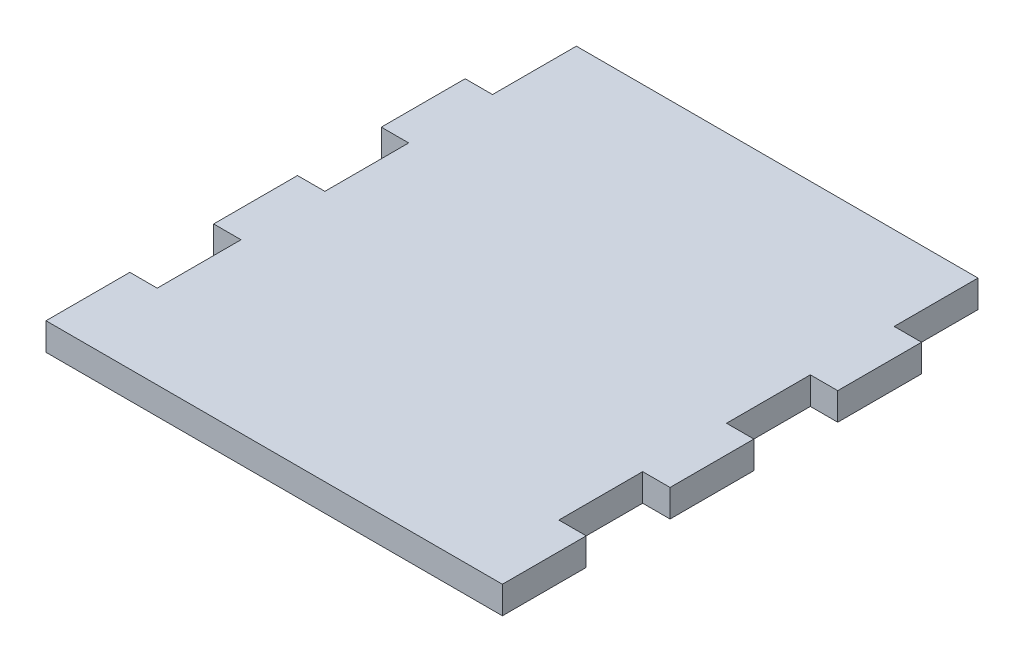
ISO-10303-21;
HEADER;
FILE_DESCRIPTION(('STEP AP214'),'2;1');
FILE_NAME('part.step','',(''),(''),'','','');
FILE_SCHEMA(('AUTOMOTIVE_DESIGN { 1 0 10303 214 1 1 1 1 }'));
ENDSEC;
DATA;
#1=APPLICATION_CONTEXT('core data for automotive mechanical design processes');
#2=APPLICATION_PROTOCOL_DEFINITION('international standard','automotive_design',2000,#1);
#3=PRODUCT_CONTEXT('',#1,'mechanical');
#4=PRODUCT('Part','Part','',(#3));
#5=PRODUCT_RELATED_PRODUCT_CATEGORY('part','',(#4));
#6=PRODUCT_DEFINITION_FORMATION('','',#4);
#7=PRODUCT_DEFINITION_CONTEXT('part definition',#1,'design');
#8=PRODUCT_DEFINITION('design','',#6,#7);
#9=PRODUCT_DEFINITION_SHAPE('','',#8);
#10=(LENGTH_UNIT() NAMED_UNIT(*) SI_UNIT(.MILLI.,.METRE.));
#11=(NAMED_UNIT(*) PLANE_ANGLE_UNIT() SI_UNIT($,.RADIAN.));
#12=(NAMED_UNIT(*) SI_UNIT($,.STERADIAN.) SOLID_ANGLE_UNIT());
#13=UNCERTAINTY_MEASURE_WITH_UNIT(LENGTH_MEASURE(1.E-05),#10,'distance_accuracy_value','');
#14=(GEOMETRIC_REPRESENTATION_CONTEXT(3) GLOBAL_UNCERTAINTY_ASSIGNED_CONTEXT((#13)) GLOBAL_UNIT_ASSIGNED_CONTEXT((#10,
#11,#12)) REPRESENTATION_CONTEXT('',''));
#15=CARTESIAN_POINT('',(0.,0.,0.));
#16=DIRECTION('',(0.,0.,1.));
#17=DIRECTION('',(1.,0.,0.));
#18=AXIS2_PLACEMENT_3D('',#15,#16,#17);
#19=CARTESIAN_POINT('',(-44.45,5.334,57.15));
#20=DIRECTION('',(1.,0.,0.));
#21=DIRECTION('',(0.,0.,-1.));
#22=AXIS2_PLACEMENT_3D('',#19,#20,#21);
#23=PLANE('',#22);
#24=DIRECTION('',(0.,0.,1.));
#25=VECTOR('',#24,1.);
#26=CARTESIAN_POINT('',(-44.45,0.,57.15));
#27=LINE('',#26,#25);
#28=CARTESIAN_POINT('',(-44.45,0.,8.16428571428571));
#29=VERTEX_POINT('',#28);
#30=CARTESIAN_POINT('',(-44.45,0.,24.4928571428571));
#31=VERTEX_POINT('',#30);
#32=EDGE_CURVE('E318',#29,#31,#27,.T.);
#33=ORIENTED_EDGE('',*,*,#32,.T.);
#34=DIRECTION('',(0.,1.,0.));
#35=VECTOR('',#34,1.);
#36=CARTESIAN_POINT('',(-44.45,0.,24.4928571428571));
#37=LINE('',#36,#35);
#38=CARTESIAN_POINT('',(-44.45,5.334,24.4928571428571));
#39=VERTEX_POINT('',#38);
#40=EDGE_CURVE('E352',#31,#39,#37,.T.);
#41=ORIENTED_EDGE('',*,*,#40,.T.);
#42=DIRECTION('',(0.,0.,1.));
#43=VECTOR('',#42,1.);
#44=CARTESIAN_POINT('',(-44.45,5.334,57.15));
#45=LINE('',#44,#43);
#46=CARTESIAN_POINT('',(-44.45,5.334,8.16428571428571));
#47=VERTEX_POINT('',#46);
#48=EDGE_CURVE('E308',#47,#39,#45,.T.);
#49=ORIENTED_EDGE('',*,*,#48,.F.);
#50=DIRECTION('',(0.,1.,0.));
#51=VECTOR('',#50,1.);
#52=CARTESIAN_POINT('',(-44.45,0.,8.16428571428571));
#53=LINE('',#52,#51);
#54=EDGE_CURVE('E390',#29,#47,#53,.T.);
#55=ORIENTED_EDGE('',*,*,#54,.F.);
#56=EDGE_LOOP('',(#33,#41,#49,#55));
#57=FACE_BOUND('',#56,.T.);
#58=ADVANCED_FACE('F34',(#57),#23,.F.);
#59=CARTESIAN_POINT('',(-44.45,0.,-24.4928571428572));
#60=VERTEX_POINT('',#59);
#61=CARTESIAN_POINT('',(-44.45,0.,-8.16428571428572));
#62=VERTEX_POINT('',#61);
#63=EDGE_CURVE('E319',#60,#62,#27,.T.);
#64=ORIENTED_EDGE('',*,*,#63,.T.);
#65=DIRECTION('',(0.,1.,0.));
#66=VECTOR('',#65,1.);
#67=CARTESIAN_POINT('',(-44.45,0.,-8.16428571428572));
#68=LINE('',#67,#66);
#69=CARTESIAN_POINT('',(-44.45,5.334,-8.16428571428572));
#70=VERTEX_POINT('',#69);
#71=EDGE_CURVE('E380',#62,#70,#68,.T.);
#72=ORIENTED_EDGE('',*,*,#71,.T.);
#73=CARTESIAN_POINT('',(-44.45,5.334,-24.4928571428572));
#74=VERTEX_POINT('',#73);
#75=EDGE_CURVE('E309',#74,#70,#45,.T.);
#76=ORIENTED_EDGE('',*,*,#75,.F.);
#77=DIRECTION('',(0.,1.,0.));
#78=VECTOR('',#77,1.);
#79=CARTESIAN_POINT('',(-44.45,0.,-24.4928571428572));
#80=LINE('',#79,#78);
#81=EDGE_CURVE('E230',#60,#74,#80,.T.);
#82=ORIENTED_EDGE('',*,*,#81,.F.);
#83=EDGE_LOOP('',(#64,#72,#76,#82));
#84=FACE_BOUND('',#83,.T.);
#85=ADVANCED_FACE('F403',(#84),#23,.F.);
#86=CARTESIAN_POINT('',(44.45,5.334,57.15));
#87=DIRECTION('',(-1.,0.,0.));
#88=DIRECTION('',(0.,0.,1.));
#89=AXIS2_PLACEMENT_3D('',#86,#87,#88);
#90=PLANE('',#89);
#91=DIRECTION('',(0.,0.,-1.));
#92=VECTOR('',#91,1.);
#93=CARTESIAN_POINT('',(44.45,0.,57.15));
#94=LINE('',#93,#92);
#95=CARTESIAN_POINT('',(44.45,0.,-8.16428571428572));
#96=VERTEX_POINT('',#95);
#97=CARTESIAN_POINT('',(44.45,0.,-24.4928571428572));
#98=VERTEX_POINT('',#97);
#99=EDGE_CURVE('E295',#96,#98,#94,.T.);
#100=ORIENTED_EDGE('',*,*,#99,.T.);
#101=DIRECTION('',(0.,1.,0.));
#102=VECTOR('',#101,1.);
#103=CARTESIAN_POINT('',(44.45,0.,-24.4928571428572));
#104=LINE('',#103,#102);
#105=CARTESIAN_POINT('',(44.45,5.334,-24.4928571428572));
#106=VERTEX_POINT('',#105);
#107=EDGE_CURVE('E242',#98,#106,#104,.T.);
#108=ORIENTED_EDGE('',*,*,#107,.T.);
#109=DIRECTION('',(0.,0.,-1.));
#110=VECTOR('',#109,1.);
#111=CARTESIAN_POINT('',(44.45,5.334,57.15));
#112=LINE('',#111,#110);
#113=CARTESIAN_POINT('',(44.45,5.334,-8.16428571428572));
#114=VERTEX_POINT('',#113);
#115=EDGE_CURVE('E306',#114,#106,#112,.T.);
#116=ORIENTED_EDGE('',*,*,#115,.F.);
#117=DIRECTION('',(0.,1.,0.));
#118=VECTOR('',#117,1.);
#119=CARTESIAN_POINT('',(44.45,0.,-8.16428571428572));
#120=LINE('',#119,#118);
#121=EDGE_CURVE('E259',#96,#114,#120,.T.);
#122=ORIENTED_EDGE('',*,*,#121,.F.);
#123=EDGE_LOOP('',(#100,#108,#116,#122));
#124=FACE_BOUND('',#123,.T.);
#125=ADVANCED_FACE('F36',(#124),#90,.F.);
#126=CARTESIAN_POINT('',(44.45,0.,24.4928571428571));
#127=VERTEX_POINT('',#126);
#128=CARTESIAN_POINT('',(44.45,0.,8.16428571428571));
#129=VERTEX_POINT('',#128);
#130=EDGE_CURVE('E316',#127,#129,#94,.T.);
#131=ORIENTED_EDGE('',*,*,#130,.T.);
#132=DIRECTION('',(0.,1.,0.));
#133=VECTOR('',#132,1.);
#134=CARTESIAN_POINT('',(44.45,0.,8.16428571428571));
#135=LINE('',#134,#133);
#136=CARTESIAN_POINT('',(44.45,5.334,8.16428571428571));
#137=VERTEX_POINT('',#136);
#138=EDGE_CURVE('E266',#129,#137,#135,.T.);
#139=ORIENTED_EDGE('',*,*,#138,.T.);
#140=CARTESIAN_POINT('',(44.45,5.334,24.4928571428571));
#141=VERTEX_POINT('',#140);
#142=EDGE_CURVE('E305',#141,#137,#112,.T.);
#143=ORIENTED_EDGE('',*,*,#142,.F.);
#144=DIRECTION('',(0.,1.,0.));
#145=VECTOR('',#144,1.);
#146=CARTESIAN_POINT('',(44.45,0.,24.4928571428571));
#147=LINE('',#146,#145);
#148=EDGE_CURVE('E285',#127,#141,#147,.T.);
#149=ORIENTED_EDGE('',*,*,#148,.F.);
#150=EDGE_LOOP('',(#131,#139,#143,#149));
#151=FACE_BOUND('',#150,.T.);
#152=ADVANCED_FACE('F444',(#151),#90,.F.);
#153=CARTESIAN_POINT('',(44.45,0.,57.15));
#154=VERTEX_POINT('',#153);
#155=CARTESIAN_POINT('',(44.45,0.,40.8214285714286));
#156=VERTEX_POINT('',#155);
#157=EDGE_CURVE('E312',#154,#156,#94,.T.);
#158=ORIENTED_EDGE('',*,*,#157,.T.);
#159=DIRECTION('',(0.,1.,0.));
#160=VECTOR('',#159,1.);
#161=CARTESIAN_POINT('',(44.45,0.,40.8214285714286));
#162=LINE('',#161,#160);
#163=CARTESIAN_POINT('',(44.45,5.334,40.8214285714286));
#164=VERTEX_POINT('',#163);
#165=EDGE_CURVE('E292',#156,#164,#162,.T.);
#166=ORIENTED_EDGE('',*,*,#165,.T.);
#167=CARTESIAN_POINT('',(44.45,5.334,57.15));
#168=VERTEX_POINT('',#167);
#169=EDGE_CURVE('E301',#168,#164,#112,.T.);
#170=ORIENTED_EDGE('',*,*,#169,.F.);
#171=DIRECTION('',(0.,-1.,0.));
#172=VECTOR('',#171,1.);
#173=CARTESIAN_POINT('',(44.45,5.334,57.15));
#174=LINE('',#173,#172);
#175=EDGE_CURVE('E42',#168,#154,#174,.T.);
#176=ORIENTED_EDGE('',*,*,#175,.T.);
#177=EDGE_LOOP('',(#158,#166,#170,#176));
#178=FACE_BOUND('',#177,.T.);
#179=ADVANCED_FACE('F326',(#178),#90,.F.);
#180=CARTESIAN_POINT('',(-44.45,5.334,40.8214285714286));
#181=VERTEX_POINT('',#180);
#182=CARTESIAN_POINT('',(-44.45,5.334,57.15));
#183=VERTEX_POINT('',#182);
#184=EDGE_CURVE('E304',#181,#183,#45,.T.);
#185=ORIENTED_EDGE('',*,*,#184,.F.);
#186=DIRECTION('',(0.,1.,0.));
#187=VECTOR('',#186,1.);
#188=CARTESIAN_POINT('',(-44.45,0.,40.8214285714286));
#189=LINE('',#188,#187);
#190=CARTESIAN_POINT('',(-44.45,0.,40.8214285714286));
#191=VERTEX_POINT('',#190);
#192=EDGE_CURVE('E345',#191,#181,#189,.T.);
#193=ORIENTED_EDGE('',*,*,#192,.F.);
#194=CARTESIAN_POINT('',(-44.45,0.,57.15));
#195=VERTEX_POINT('',#194);
#196=EDGE_CURVE('E315',#191,#195,#27,.T.);
#197=ORIENTED_EDGE('',*,*,#196,.T.);
#198=DIRECTION('',(0.,-1.,0.));
#199=VECTOR('',#198,1.);
#200=CARTESIAN_POINT('',(-44.45,5.334,57.15));
#201=LINE('',#200,#199);
#202=EDGE_CURVE('E11',#183,#195,#201,.T.);
#203=ORIENTED_EDGE('',*,*,#202,.F.);
#204=EDGE_LOOP('',(#185,#193,#197,#203));
#205=FACE_BOUND('',#204,.T.);
#206=ADVANCED_FACE('F343',(#205),#23,.F.);
#207=CARTESIAN_POINT('',(-44.45,5.334,57.15));
#208=DIRECTION('',(0.,0.,-1.));
#209=DIRECTION('',(-1.,0.,0.));
#210=AXIS2_PLACEMENT_3D('',#207,#208,#209);
#211=PLANE('',#210);
#212=DIRECTION('',(1.,0.,0.));
#213=VECTOR('',#212,1.);
#214=CARTESIAN_POINT('',(-44.45,0.,57.15));
#215=LINE('',#214,#213);
#216=EDGE_CURVE('E320',#195,#154,#215,.T.);
#217=ORIENTED_EDGE('',*,*,#216,.T.);
#218=ORIENTED_EDGE('',*,*,#175,.F.);
#219=DIRECTION('',(1.,0.,0.));
#220=VECTOR('',#219,1.);
#221=CARTESIAN_POINT('',(-44.45,5.334,57.15));
#222=LINE('',#221,#220);
#223=EDGE_CURVE('E310',#183,#168,#222,.T.);
#224=ORIENTED_EDGE('',*,*,#223,.F.);
#225=ORIENTED_EDGE('',*,*,#202,.T.);
#226=EDGE_LOOP('',(#217,#218,#224,#225));
#227=FACE_BOUND('',#226,.T.);
#228=ADVANCED_FACE('F341',(#227),#211,.F.);
#229=CARTESIAN_POINT('',(44.45,5.334,-57.15));
#230=DIRECTION('',(0.,-1.,0.));
#231=DIRECTION('',(0.,0.,-1.));
#232=AXIS2_PLACEMENT_3D('',#229,#230,#231);
#233=PLANE('',#232);
#234=DIRECTION('',(0.,0.,1.));
#235=VECTOR('',#234,1.);
#236=CARTESIAN_POINT('',(39.116,5.334,-24.4928571428572));
#237=LINE('',#236,#235);
#238=CARTESIAN_POINT('',(39.116,5.334,-40.8214285714286));
#239=VERTEX_POINT('',#238);
#240=CARTESIAN_POINT('',(39.116,5.334,-24.4928571428572));
#241=VERTEX_POINT('',#240);
#242=EDGE_CURVE('E204',#239,#241,#237,.T.);
#243=ORIENTED_EDGE('',*,*,#242,.F.);
#244=DIRECTION('',(1.,0.,0.));
#245=VECTOR('',#244,1.);
#246=CARTESIAN_POINT('',(44.45,5.334,-40.8214285714286));
#247=LINE('',#246,#245);
#248=CARTESIAN_POINT('',(-39.116,5.334,-40.8214285714286));
#249=VERTEX_POINT('',#248);
#250=EDGE_CURVE('E197',#249,#239,#247,.T.);
#251=ORIENTED_EDGE('',*,*,#250,.F.);
#252=DIRECTION('',(0.,0.,-1.));
#253=VECTOR('',#252,1.);
#254=CARTESIAN_POINT('',(-39.116,5.334,-24.4928571428572));
#255=LINE('',#254,#253);
#256=CARTESIAN_POINT('',(-39.116,5.334,-24.4928571428572));
#257=VERTEX_POINT('',#256);
#258=EDGE_CURVE('E212',#257,#249,#255,.T.);
#259=ORIENTED_EDGE('',*,*,#258,.F.);
#260=DIRECTION('',(1.,0.,0.));
#261=VECTOR('',#260,1.);
#262=CARTESIAN_POINT('',(-44.45,5.334,-24.4928571428572));
#263=LINE('',#262,#261);
#264=EDGE_CURVE('E220',#74,#257,#263,.T.);
#265=ORIENTED_EDGE('',*,*,#264,.F.);
#266=ORIENTED_EDGE('',*,*,#75,.T.);
#267=DIRECTION('',(-1.,0.,0.));
#268=VECTOR('',#267,1.);
#269=CARTESIAN_POINT('',(-44.45,5.334,-8.16428571428572));
#270=LINE('',#269,#268);
#271=CARTESIAN_POINT('',(-39.116,5.334,-8.16428571428572));
#272=VERTEX_POINT('',#271);
#273=EDGE_CURVE('E366',#272,#70,#270,.T.);
#274=ORIENTED_EDGE('',*,*,#273,.F.);
#275=DIRECTION('',(0.,0.,-1.));
#276=VECTOR('',#275,1.);
#277=CARTESIAN_POINT('',(-39.116,5.334,8.16428571428571));
#278=LINE('',#277,#276);
#279=CARTESIAN_POINT('',(-39.116,5.334,8.16428571428571));
#280=VERTEX_POINT('',#279);
#281=EDGE_CURVE('E376',#280,#272,#278,.T.);
#282=ORIENTED_EDGE('',*,*,#281,.F.);
#283=DIRECTION('',(1.,0.,0.));
#284=VECTOR('',#283,1.);
#285=CARTESIAN_POINT('',(-44.45,5.334,8.16428571428571));
#286=LINE('',#285,#284);
#287=EDGE_CURVE('E382',#47,#280,#286,.T.);
#288=ORIENTED_EDGE('',*,*,#287,.F.);
#289=ORIENTED_EDGE('',*,*,#48,.T.);
#290=DIRECTION('',(-1.,0.,0.));
#291=VECTOR('',#290,1.);
#292=CARTESIAN_POINT('',(-44.45,5.334,24.4928571428571));
#293=LINE('',#292,#291);
#294=CARTESIAN_POINT('',(-39.116,5.334,24.4928571428571));
#295=VERTEX_POINT('',#294);
#296=EDGE_CURVE('E357',#295,#39,#293,.T.);
#297=ORIENTED_EDGE('',*,*,#296,.F.);
#298=DIRECTION('',(0.,0.,-1.));
#299=VECTOR('',#298,1.);
#300=CARTESIAN_POINT('',(-39.116,5.334,40.8214285714286));
#301=LINE('',#300,#299);
#302=CARTESIAN_POINT('',(-39.116,5.334,40.8214285714286));
#303=VERTEX_POINT('',#302);
#304=EDGE_CURVE('E354',#303,#295,#301,.T.);
#305=ORIENTED_EDGE('',*,*,#304,.F.);
#306=DIRECTION('',(1.,0.,0.));
#307=VECTOR('',#306,1.);
#308=CARTESIAN_POINT('',(-44.45,5.334,40.8214285714286));
#309=LINE('',#308,#307);
#310=EDGE_CURVE('E359',#181,#303,#309,.T.);
#311=ORIENTED_EDGE('',*,*,#310,.F.);
#312=ORIENTED_EDGE('',*,*,#184,.T.);
#313=ORIENTED_EDGE('',*,*,#223,.T.);
#314=ORIENTED_EDGE('',*,*,#169,.T.);
#315=DIRECTION('',(1.,0.,0.));
#316=VECTOR('',#315,1.);
#317=CARTESIAN_POINT('',(44.45,5.334,40.8214285714286));
#318=LINE('',#317,#316);
#319=CARTESIAN_POINT('',(39.116,5.334,40.8214285714286));
#320=VERTEX_POINT('',#319);
#321=EDGE_CURVE('E279',#320,#164,#318,.T.);
#322=ORIENTED_EDGE('',*,*,#321,.F.);
#323=DIRECTION('',(0.,0.,1.));
#324=VECTOR('',#323,1.);
#325=CARTESIAN_POINT('',(39.116,5.334,40.8214285714286));
#326=LINE('',#325,#324);
#327=CARTESIAN_POINT('',(39.116,5.334,24.4928571428571));
#328=VERTEX_POINT('',#327);
#329=EDGE_CURVE('E288',#328,#320,#326,.T.);
#330=ORIENTED_EDGE('',*,*,#329,.F.);
#331=DIRECTION('',(-1.,0.,0.));
#332=VECTOR('',#331,1.);
#333=CARTESIAN_POINT('',(44.45,5.334,24.4928571428571));
#334=LINE('',#333,#332);
#335=EDGE_CURVE('E269',#141,#328,#334,.T.);
#336=ORIENTED_EDGE('',*,*,#335,.F.);
#337=ORIENTED_EDGE('',*,*,#142,.T.);
#338=DIRECTION('',(1.,0.,0.));
#339=VECTOR('',#338,1.);
#340=CARTESIAN_POINT('',(44.45,5.334,8.16428571428571));
#341=LINE('',#340,#339);
#342=CARTESIAN_POINT('',(39.116,5.334,8.16428571428571));
#343=VERTEX_POINT('',#342);
#344=EDGE_CURVE('E253',#343,#137,#341,.T.);
#345=ORIENTED_EDGE('',*,*,#344,.F.);
#346=DIRECTION('',(0.,0.,1.));
#347=VECTOR('',#346,1.);
#348=CARTESIAN_POINT('',(39.116,5.334,8.16428571428571));
#349=LINE('',#348,#347);
#350=CARTESIAN_POINT('',(39.116,5.334,-8.16428571428572));
#351=VERTEX_POINT('',#350);
#352=EDGE_CURVE('E262',#351,#343,#349,.T.);
#353=ORIENTED_EDGE('',*,*,#352,.F.);
#354=DIRECTION('',(-1.,0.,0.));
#355=VECTOR('',#354,1.);
#356=CARTESIAN_POINT('',(44.45,5.334,-8.16428571428572));
#357=LINE('',#356,#355);
#358=EDGE_CURVE('E245',#114,#351,#357,.T.);
#359=ORIENTED_EDGE('',*,*,#358,.F.);
#360=ORIENTED_EDGE('',*,*,#115,.T.);
#361=DIRECTION('',(1.,0.,0.));
#362=VECTOR('',#361,1.);
#363=CARTESIAN_POINT('',(44.45,5.334,-24.4928571428572));
#364=LINE('',#363,#362);
#365=EDGE_CURVE('E236',#241,#106,#364,.T.);
#366=ORIENTED_EDGE('',*,*,#365,.F.);
#367=EDGE_LOOP('',(#243,#251,#259,#265,#266,#274,#282,#288,#289,#297,#305,#311,#312,#313,#314,
#322,#330,#336,#337,#345,#353,#359,#360,#366));
#368=FACE_BOUND('',#367,.T.);
#369=ADVANCED_FACE('F210',(#368),#233,.F.);
#370=CARTESIAN_POINT('',(44.45,0.,-57.15));
#371=DIRECTION('',(0.,-1.,0.));
#372=DIRECTION('',(0.,0.,-1.));
#373=AXIS2_PLACEMENT_3D('',#370,#371,#372);
#374=PLANE('',#373);
#375=DIRECTION('',(1.,0.,0.));
#376=VECTOR('',#375,1.);
#377=CARTESIAN_POINT('',(-44.45,0.,-40.8214285714286));
#378=LINE('',#377,#376);
#379=CARTESIAN_POINT('',(-39.116,0.,-40.8214285714286));
#380=VERTEX_POINT('',#379);
#381=CARTESIAN_POINT('',(39.116,0.,-40.8214285714286));
#382=VERTEX_POINT('',#381);
#383=EDGE_CURVE('E200',#380,#382,#378,.T.);
#384=ORIENTED_EDGE('',*,*,#383,.T.);
#385=DIRECTION('',(0.,0.,1.));
#386=VECTOR('',#385,1.);
#387=CARTESIAN_POINT('',(39.116,0.,-24.4928571428572));
#388=LINE('',#387,#386);
#389=CARTESIAN_POINT('',(39.116,0.,-24.4928571428572));
#390=VERTEX_POINT('',#389);
#391=EDGE_CURVE('E232',#382,#390,#388,.T.);
#392=ORIENTED_EDGE('',*,*,#391,.T.);
#393=DIRECTION('',(1.,0.,0.));
#394=VECTOR('',#393,1.);
#395=CARTESIAN_POINT('',(44.45,0.,-24.4928571428572));
#396=LINE('',#395,#394);
#397=EDGE_CURVE('E235',#390,#98,#396,.T.);
#398=ORIENTED_EDGE('',*,*,#397,.T.);
#399=ORIENTED_EDGE('',*,*,#99,.F.);
#400=DIRECTION('',(-1.,0.,0.));
#401=VECTOR('',#400,1.);
#402=CARTESIAN_POINT('',(44.45,0.,-8.16428571428572));
#403=LINE('',#402,#401);
#404=CARTESIAN_POINT('',(39.116,0.,-8.16428571428572));
#405=VERTEX_POINT('',#404);
#406=EDGE_CURVE('E249',#96,#405,#403,.T.);
#407=ORIENTED_EDGE('',*,*,#406,.T.);
#408=DIRECTION('',(0.,0.,1.));
#409=VECTOR('',#408,1.);
#410=CARTESIAN_POINT('',(39.116,0.,8.16428571428571));
#411=LINE('',#410,#409);
#412=CARTESIAN_POINT('',(39.116,0.,8.16428571428571));
#413=VERTEX_POINT('',#412);
#414=EDGE_CURVE('E252',#405,#413,#411,.T.);
#415=ORIENTED_EDGE('',*,*,#414,.T.);
#416=DIRECTION('',(1.,0.,0.));
#417=VECTOR('',#416,1.);
#418=CARTESIAN_POINT('',(44.45,0.,8.16428571428571));
#419=LINE('',#418,#417);
#420=EDGE_CURVE('E256',#413,#129,#419,.T.);
#421=ORIENTED_EDGE('',*,*,#420,.T.);
#422=ORIENTED_EDGE('',*,*,#130,.F.);
#423=DIRECTION('',(-1.,0.,0.));
#424=VECTOR('',#423,1.);
#425=CARTESIAN_POINT('',(44.45,0.,24.4928571428571));
#426=LINE('',#425,#424);
#427=CARTESIAN_POINT('',(39.116,0.,24.4928571428571));
#428=VERTEX_POINT('',#427);
#429=EDGE_CURVE('E275',#127,#428,#426,.T.);
#430=ORIENTED_EDGE('',*,*,#429,.T.);
#431=DIRECTION('',(0.,0.,1.));
#432=VECTOR('',#431,1.);
#433=CARTESIAN_POINT('',(39.116,0.,40.8214285714286));
#434=LINE('',#433,#432);
#435=CARTESIAN_POINT('',(39.116,0.,40.8214285714286));
#436=VERTEX_POINT('',#435);
#437=EDGE_CURVE('E278',#428,#436,#434,.T.);
#438=ORIENTED_EDGE('',*,*,#437,.T.);
#439=DIRECTION('',(1.,0.,0.));
#440=VECTOR('',#439,1.);
#441=CARTESIAN_POINT('',(44.45,0.,40.8214285714286));
#442=LINE('',#441,#440);
#443=EDGE_CURVE('E282',#436,#156,#442,.T.);
#444=ORIENTED_EDGE('',*,*,#443,.T.);
#445=ORIENTED_EDGE('',*,*,#157,.F.);
#446=ORIENTED_EDGE('',*,*,#216,.F.);
#447=ORIENTED_EDGE('',*,*,#196,.F.);
#448=DIRECTION('',(1.,0.,0.));
#449=VECTOR('',#448,1.);
#450=CARTESIAN_POINT('',(-44.45,0.,40.8214285714286));
#451=LINE('',#450,#449);
#452=CARTESIAN_POINT('',(-39.116,0.,40.8214285714286));
#453=VERTEX_POINT('',#452);
#454=EDGE_CURVE('E347',#191,#453,#451,.T.);
#455=ORIENTED_EDGE('',*,*,#454,.T.);
#456=DIRECTION('',(0.,0.,-1.));
#457=VECTOR('',#456,1.);
#458=CARTESIAN_POINT('',(-39.116,0.,40.8214285714286));
#459=LINE('',#458,#457);
#460=CARTESIAN_POINT('',(-39.116,0.,24.4928571428571));
#461=VERTEX_POINT('',#460);
#462=EDGE_CURVE('E49',#453,#461,#459,.T.);
#463=ORIENTED_EDGE('',*,*,#462,.T.);
#464=DIRECTION('',(-1.,0.,0.));
#465=VECTOR('',#464,1.);
#466=CARTESIAN_POINT('',(-44.45,0.,24.4928571428571));
#467=LINE('',#466,#465);
#468=EDGE_CURVE('E350',#461,#31,#467,.T.);
#469=ORIENTED_EDGE('',*,*,#468,.T.);
#470=ORIENTED_EDGE('',*,*,#32,.F.);
#471=DIRECTION('',(1.,0.,0.));
#472=VECTOR('',#471,1.);
#473=CARTESIAN_POINT('',(-44.45,0.,8.16428571428571));
#474=LINE('',#473,#472);
#475=CARTESIAN_POINT('',(-39.116,0.,8.16428571428571));
#476=VERTEX_POINT('',#475);
#477=EDGE_CURVE('E375',#29,#476,#474,.T.);
#478=ORIENTED_EDGE('',*,*,#477,.T.);
#479=DIRECTION('',(0.,0.,-1.));
#480=VECTOR('',#479,1.);
#481=CARTESIAN_POINT('',(-39.116,0.,8.16428571428571));
#482=LINE('',#481,#480);
#483=CARTESIAN_POINT('',(-39.116,0.,-8.16428571428572));
#484=VERTEX_POINT('',#483);
#485=EDGE_CURVE('E57',#476,#484,#482,.T.);
#486=ORIENTED_EDGE('',*,*,#485,.T.);
#487=DIRECTION('',(-1.,0.,0.));
#488=VECTOR('',#487,1.);
#489=CARTESIAN_POINT('',(-44.45,0.,-8.16428571428572));
#490=LINE('',#489,#488);
#491=EDGE_CURVE('E372',#484,#62,#490,.T.);
#492=ORIENTED_EDGE('',*,*,#491,.T.);
#493=ORIENTED_EDGE('',*,*,#63,.F.);
#494=DIRECTION('',(1.,0.,0.));
#495=VECTOR('',#494,1.);
#496=CARTESIAN_POINT('',(-44.45,0.,-24.4928571428572));
#497=LINE('',#496,#495);
#498=CARTESIAN_POINT('',(-39.116,0.,-24.4928571428572));
#499=VERTEX_POINT('',#498);
#500=EDGE_CURVE('E219',#60,#499,#497,.T.);
#501=ORIENTED_EDGE('',*,*,#500,.T.);
#502=DIRECTION('',(0.,0.,-1.));
#503=VECTOR('',#502,1.);
#504=CARTESIAN_POINT('',(-39.116,0.,-24.4928571428572));
#505=LINE('',#504,#503);
#506=EDGE_CURVE('E223',#499,#380,#505,.T.);
#507=ORIENTED_EDGE('',*,*,#506,.T.);
#508=EDGE_LOOP('',(#384,#392,#398,#399,#407,#415,#421,#422,#430,#438,#444,#445,#446,#447,#455,
#463,#469,#470,#478,#486,#492,#493,#501,#507));
#509=FACE_BOUND('',#508,.T.);
#510=ADVANCED_FACE('F331',(#509),#374,.T.);
#511=CARTESIAN_POINT('',(44.45,0.,40.8214285714286));
#512=DIRECTION('',(0.,0.,1.));
#513=DIRECTION('',(1.,0.,0.));
#514=AXIS2_PLACEMENT_3D('',#511,#512,#513);
#515=PLANE('',#514);
#516=ORIENTED_EDGE('',*,*,#321,.T.);
#517=ORIENTED_EDGE('',*,*,#165,.F.);
#518=ORIENTED_EDGE('',*,*,#443,.F.);
#519=DIRECTION('',(0.,1.,0.));
#520=VECTOR('',#519,1.);
#521=CARTESIAN_POINT('',(39.116,0.,40.8214285714286));
#522=LINE('',#521,#520);
#523=EDGE_CURVE('E296',#436,#320,#522,.T.);
#524=ORIENTED_EDGE('',*,*,#523,.T.);
#525=EDGE_LOOP('',(#516,#517,#518,#524));
#526=FACE_BOUND('',#525,.T.);
#527=ADVANCED_FACE('F335',(#526),#515,.F.);
#528=CARTESIAN_POINT('',(39.116,0.,40.8214285714286));
#529=DIRECTION('',(-1.,0.,0.));
#530=DIRECTION('',(0.,0.,1.));
#531=AXIS2_PLACEMENT_3D('',#528,#529,#530);
#532=PLANE('',#531);
#533=ORIENTED_EDGE('',*,*,#329,.T.);
#534=ORIENTED_EDGE('',*,*,#523,.F.);
#535=ORIENTED_EDGE('',*,*,#437,.F.);
#536=DIRECTION('',(0.,1.,0.));
#537=VECTOR('',#536,1.);
#538=CARTESIAN_POINT('',(39.116,0.,24.4928571428571));
#539=LINE('',#538,#537);
#540=EDGE_CURVE('E298',#428,#328,#539,.T.);
#541=ORIENTED_EDGE('',*,*,#540,.T.);
#542=EDGE_LOOP('',(#533,#534,#535,#541));
#543=FACE_BOUND('',#542,.T.);
#544=ADVANCED_FACE('F489',(#543),#532,.F.);
#545=CARTESIAN_POINT('',(44.45,0.,24.4928571428571));
#546=DIRECTION('',(0.,0.,-1.));
#547=DIRECTION('',(-1.,0.,0.));
#548=AXIS2_PLACEMENT_3D('',#545,#546,#547);
#549=PLANE('',#548);
#550=ORIENTED_EDGE('',*,*,#335,.T.);
#551=ORIENTED_EDGE('',*,*,#540,.F.);
#552=ORIENTED_EDGE('',*,*,#429,.F.);
#553=ORIENTED_EDGE('',*,*,#148,.T.);
#554=EDGE_LOOP('',(#550,#551,#552,#553));
#555=FACE_BOUND('',#554,.T.);
#556=ADVANCED_FACE('F483',(#555),#549,.F.);
#557=CARTESIAN_POINT('',(44.45,0.,8.16428571428571));
#558=DIRECTION('',(0.,0.,1.));
#559=DIRECTION('',(1.,0.,0.));
#560=AXIS2_PLACEMENT_3D('',#557,#558,#559);
#561=PLANE('',#560);
#562=ORIENTED_EDGE('',*,*,#344,.T.);
#563=ORIENTED_EDGE('',*,*,#138,.F.);
#564=ORIENTED_EDGE('',*,*,#420,.F.);
#565=DIRECTION('',(0.,1.,0.));
#566=VECTOR('',#565,1.);
#567=CARTESIAN_POINT('',(39.116,0.,8.16428571428571));
#568=LINE('',#567,#566);
#569=EDGE_CURVE('E270',#413,#343,#568,.T.);
#570=ORIENTED_EDGE('',*,*,#569,.T.);
#571=EDGE_LOOP('',(#562,#563,#564,#570));
#572=FACE_BOUND('',#571,.T.);
#573=ADVANCED_FACE('F465',(#572),#561,.F.);
#574=CARTESIAN_POINT('',(39.116,0.,8.16428571428571));
#575=DIRECTION('',(-1.,0.,0.));
#576=DIRECTION('',(0.,0.,1.));
#577=AXIS2_PLACEMENT_3D('',#574,#575,#576);
#578=PLANE('',#577);
#579=ORIENTED_EDGE('',*,*,#352,.T.);
#580=ORIENTED_EDGE('',*,*,#569,.F.);
#581=ORIENTED_EDGE('',*,*,#414,.F.);
#582=DIRECTION('',(0.,1.,0.));
#583=VECTOR('',#582,1.);
#584=CARTESIAN_POINT('',(39.116,0.,-8.16428571428572));
#585=LINE('',#584,#583);
#586=EDGE_CURVE('E272',#405,#351,#585,.T.);
#587=ORIENTED_EDGE('',*,*,#586,.T.);
#588=EDGE_LOOP('',(#579,#580,#581,#587));
#589=FACE_BOUND('',#588,.T.);
#590=ADVANCED_FACE('F474',(#589),#578,.F.);
#591=CARTESIAN_POINT('',(44.45,0.,-8.16428571428572));
#592=DIRECTION('',(0.,0.,-1.));
#593=DIRECTION('',(-1.,0.,0.));
#594=AXIS2_PLACEMENT_3D('',#591,#592,#593);
#595=PLANE('',#594);
#596=ORIENTED_EDGE('',*,*,#358,.T.);
#597=ORIENTED_EDGE('',*,*,#586,.F.);
#598=ORIENTED_EDGE('',*,*,#406,.F.);
#599=ORIENTED_EDGE('',*,*,#121,.T.);
#600=EDGE_LOOP('',(#596,#597,#598,#599));
#601=FACE_BOUND('',#600,.T.);
#602=ADVANCED_FACE('F472',(#601),#595,.F.);
#603=CARTESIAN_POINT('',(44.45,0.,-24.4928571428572));
#604=DIRECTION('',(0.,0.,1.));
#605=DIRECTION('',(1.,0.,0.));
#606=AXIS2_PLACEMENT_3D('',#603,#604,#605);
#607=PLANE('',#606);
#608=ORIENTED_EDGE('',*,*,#365,.T.);
#609=ORIENTED_EDGE('',*,*,#107,.F.);
#610=ORIENTED_EDGE('',*,*,#397,.F.);
#611=DIRECTION('',(0.,1.,0.));
#612=VECTOR('',#611,1.);
#613=CARTESIAN_POINT('',(39.116,0.,-24.4928571428572));
#614=LINE('',#613,#612);
#615=EDGE_CURVE('E246',#390,#241,#614,.T.);
#616=ORIENTED_EDGE('',*,*,#615,.T.);
#617=EDGE_LOOP('',(#608,#609,#610,#616));
#618=FACE_BOUND('',#617,.T.);
#619=ADVANCED_FACE('F481',(#618),#607,.F.);
#620=CARTESIAN_POINT('',(39.116,0.,-24.4928571428572));
#621=DIRECTION('',(-1.,0.,0.));
#622=DIRECTION('',(0.,0.,1.));
#623=AXIS2_PLACEMENT_3D('',#620,#621,#622);
#624=PLANE('',#623);
#625=ORIENTED_EDGE('',*,*,#242,.T.);
#626=ORIENTED_EDGE('',*,*,#615,.F.);
#627=ORIENTED_EDGE('',*,*,#391,.F.);
#628=DIRECTION('',(0.,1.,0.));
#629=VECTOR('',#628,1.);
#630=CARTESIAN_POINT('',(39.116,0.,-40.8214285714286));
#631=LINE('',#630,#629);
#632=EDGE_CURVE('E239',#382,#239,#631,.T.);
#633=ORIENTED_EDGE('',*,*,#632,.T.);
#634=EDGE_LOOP('',(#625,#626,#627,#633));
#635=FACE_BOUND('',#634,.T.);
#636=ADVANCED_FACE('F506',(#635),#624,.F.);
#637=CARTESIAN_POINT('',(-39.116,0.,-24.4928571428572));
#638=DIRECTION('',(1.,0.,0.));
#639=DIRECTION('',(0.,0.,-1.));
#640=AXIS2_PLACEMENT_3D('',#637,#638,#639);
#641=PLANE('',#640);
#642=ORIENTED_EDGE('',*,*,#258,.T.);
#643=DIRECTION('',(0.,1.,0.));
#644=VECTOR('',#643,1.);
#645=CARTESIAN_POINT('',(-39.116,0.,-40.8214285714286));
#646=LINE('',#645,#644);
#647=EDGE_CURVE('E194',#380,#249,#646,.T.);
#648=ORIENTED_EDGE('',*,*,#647,.F.);
#649=ORIENTED_EDGE('',*,*,#506,.F.);
#650=DIRECTION('',(0.,1.,0.));
#651=VECTOR('',#650,1.);
#652=CARTESIAN_POINT('',(-39.116,0.,-24.4928571428572));
#653=LINE('',#652,#651);
#654=EDGE_CURVE('E205',#499,#257,#653,.T.);
#655=ORIENTED_EDGE('',*,*,#654,.T.);
#656=EDGE_LOOP('',(#642,#648,#649,#655));
#657=FACE_BOUND('',#656,.T.);
#658=ADVANCED_FACE('F216',(#657),#641,.F.);
#659=CARTESIAN_POINT('',(-44.45,0.,-24.4928571428572));
#660=DIRECTION('',(0.,0.,1.));
#661=DIRECTION('',(1.,0.,0.));
#662=AXIS2_PLACEMENT_3D('',#659,#660,#661);
#663=PLANE('',#662);
#664=ORIENTED_EDGE('',*,*,#264,.T.);
#665=ORIENTED_EDGE('',*,*,#654,.F.);
#666=ORIENTED_EDGE('',*,*,#500,.F.);
#667=ORIENTED_EDGE('',*,*,#81,.T.);
#668=EDGE_LOOP('',(#664,#665,#666,#667));
#669=FACE_BOUND('',#668,.T.);
#670=ADVANCED_FACE('F396',(#669),#663,.F.);
#671=CARTESIAN_POINT('',(-44.45,0.,-8.16428571428572));
#672=DIRECTION('',(0.,0.,-1.));
#673=DIRECTION('',(-1.,0.,0.));
#674=AXIS2_PLACEMENT_3D('',#671,#672,#673);
#675=PLANE('',#674);
#676=ORIENTED_EDGE('',*,*,#273,.T.);
#677=ORIENTED_EDGE('',*,*,#71,.F.);
#678=ORIENTED_EDGE('',*,*,#491,.F.);
#679=DIRECTION('',(0.,1.,0.));
#680=VECTOR('',#679,1.);
#681=CARTESIAN_POINT('',(-39.116,0.,-8.16428571428572));
#682=LINE('',#681,#680);
#683=EDGE_CURVE('E225',#484,#272,#682,.T.);
#684=ORIENTED_EDGE('',*,*,#683,.T.);
#685=EDGE_LOOP('',(#676,#677,#678,#684));
#686=FACE_BOUND('',#685,.T.);
#687=ADVANCED_FACE('F419',(#686),#675,.F.);
#688=CARTESIAN_POINT('',(-39.116,0.,8.16428571428571));
#689=DIRECTION('',(1.,0.,0.));
#690=DIRECTION('',(0.,0.,-1.));
#691=AXIS2_PLACEMENT_3D('',#688,#689,#690);
#692=PLANE('',#691);
#693=ORIENTED_EDGE('',*,*,#281,.T.);
#694=ORIENTED_EDGE('',*,*,#683,.F.);
#695=ORIENTED_EDGE('',*,*,#485,.F.);
#696=DIRECTION('',(0.,1.,0.));
#697=VECTOR('',#696,1.);
#698=CARTESIAN_POINT('',(-39.116,0.,8.16428571428571));
#699=LINE('',#698,#697);
#700=EDGE_CURVE('E388',#476,#280,#699,.T.);
#701=ORIENTED_EDGE('',*,*,#700,.T.);
#702=EDGE_LOOP('',(#693,#694,#695,#701));
#703=FACE_BOUND('',#702,.T.);
#704=ADVANCED_FACE('F420',(#703),#692,.F.);
#705=CARTESIAN_POINT('',(-44.45,0.,8.16428571428571));
#706=DIRECTION('',(0.,0.,1.));
#707=DIRECTION('',(1.,0.,0.));
#708=AXIS2_PLACEMENT_3D('',#705,#706,#707);
#709=PLANE('',#708);
#710=ORIENTED_EDGE('',*,*,#287,.T.);
#711=ORIENTED_EDGE('',*,*,#700,.F.);
#712=ORIENTED_EDGE('',*,*,#477,.F.);
#713=ORIENTED_EDGE('',*,*,#54,.T.);
#714=EDGE_LOOP('',(#710,#711,#712,#713));
#715=FACE_BOUND('',#714,.T.);
#716=ADVANCED_FACE('F422',(#715),#709,.F.);
#717=CARTESIAN_POINT('',(-44.45,0.,24.4928571428571));
#718=DIRECTION('',(0.,0.,-1.));
#719=DIRECTION('',(-1.,0.,0.));
#720=AXIS2_PLACEMENT_3D('',#717,#718,#719);
#721=PLANE('',#720);
#722=ORIENTED_EDGE('',*,*,#296,.T.);
#723=ORIENTED_EDGE('',*,*,#40,.F.);
#724=ORIENTED_EDGE('',*,*,#468,.F.);
#725=DIRECTION('',(0.,1.,0.));
#726=VECTOR('',#725,1.);
#727=CARTESIAN_POINT('',(-39.116,0.,24.4928571428571));
#728=LINE('',#727,#726);
#729=EDGE_CURVE('E364',#461,#295,#728,.T.);
#730=ORIENTED_EDGE('',*,*,#729,.T.);
#731=EDGE_LOOP('',(#722,#723,#724,#730));
#732=FACE_BOUND('',#731,.T.);
#733=ADVANCED_FACE('F416',(#732),#721,.F.);
#734=CARTESIAN_POINT('',(-39.116,0.,40.8214285714286));
#735=DIRECTION('',(1.,0.,0.));
#736=DIRECTION('',(0.,0.,-1.));
#737=AXIS2_PLACEMENT_3D('',#734,#735,#736);
#738=PLANE('',#737);
#739=ORIENTED_EDGE('',*,*,#304,.T.);
#740=ORIENTED_EDGE('',*,*,#729,.F.);
#741=ORIENTED_EDGE('',*,*,#462,.F.);
#742=DIRECTION('',(0.,1.,0.));
#743=VECTOR('',#742,1.);
#744=CARTESIAN_POINT('',(-39.116,0.,40.8214285714286));
#745=LINE('',#744,#743);
#746=EDGE_CURVE('E367',#453,#303,#745,.T.);
#747=ORIENTED_EDGE('',*,*,#746,.T.);
#748=EDGE_LOOP('',(#739,#740,#741,#747));
#749=FACE_BOUND('',#748,.T.);
#750=ADVANCED_FACE('F429',(#749),#738,.F.);
#751=CARTESIAN_POINT('',(-44.45,0.,40.8214285714286));
#752=DIRECTION('',(0.,0.,1.));
#753=DIRECTION('',(1.,0.,0.));
#754=AXIS2_PLACEMENT_3D('',#751,#752,#753);
#755=PLANE('',#754);
#756=ORIENTED_EDGE('',*,*,#310,.T.);
#757=ORIENTED_EDGE('',*,*,#746,.F.);
#758=ORIENTED_EDGE('',*,*,#454,.F.);
#759=ORIENTED_EDGE('',*,*,#192,.T.);
#760=EDGE_LOOP('',(#756,#757,#758,#759));
#761=FACE_BOUND('',#760,.T.);
#762=ADVANCED_FACE('F524',(#761),#755,.F.);
#763=CARTESIAN_POINT('',(44.45,0.,-40.8214285714286));
#764=DIRECTION('',(0.,0.,1.));
#765=DIRECTION('',(1.,0.,0.));
#766=AXIS2_PLACEMENT_3D('',#763,#764,#765);
#767=PLANE('',#766);
#768=ORIENTED_EDGE('',*,*,#383,.F.);
#769=ORIENTED_EDGE('',*,*,#647,.T.);
#770=ORIENTED_EDGE('',*,*,#250,.T.);
#771=ORIENTED_EDGE('',*,*,#632,.F.);
#772=EDGE_LOOP('',(#768,#769,#770,#771));
#773=FACE_BOUND('',#772,.T.);
#774=ADVANCED_FACE('F196',(#773),#767,.F.);
#775=CLOSED_SHELL('',(#58,#85,#125,#152,#179,#206,#228,#369,#510,#527,#544,#556,#573,#590,#602,
#619,#636,#658,#670,#687,#704,#716,#733,#750,#762,#774));
#776=MANIFOLD_SOLID_BREP('B2',#775);
#777=ADVANCED_BREP_SHAPE_REPRESENTATION('',(#18,#776),#14);
#778=SHAPE_DEFINITION_REPRESENTATION(#9,#777);
ENDSEC;
END-ISO-10303-21;
